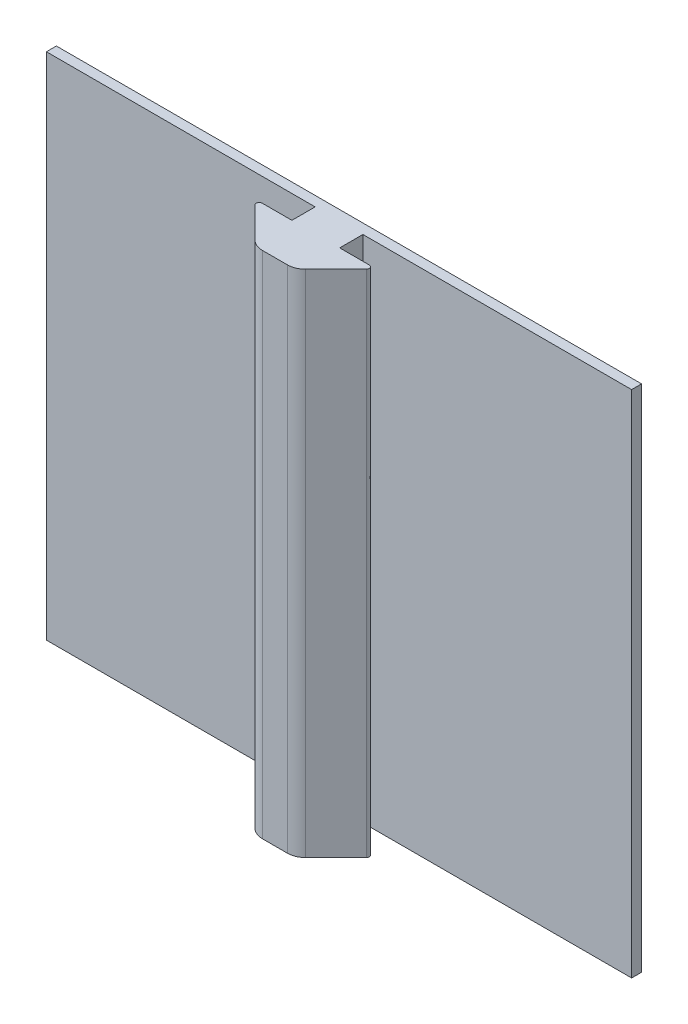
ISO-10303-21;
HEADER;
FILE_DESCRIPTION(('STEP AP214'),'2;1');
FILE_NAME('part.step','',(''),(''),'','','');
FILE_SCHEMA(('AUTOMOTIVE_DESIGN { 1 0 10303 214 1 1 1 1 }'));
ENDSEC;
DATA;
#1=APPLICATION_CONTEXT('core data for automotive mechanical design processes');
#2=APPLICATION_PROTOCOL_DEFINITION('international standard','automotive_design',2000,#1);
#3=PRODUCT_CONTEXT('',#1,'mechanical');
#4=PRODUCT('Part','Part','',(#3));
#5=PRODUCT_RELATED_PRODUCT_CATEGORY('part','',(#4));
#6=PRODUCT_DEFINITION_FORMATION('','',#4);
#7=PRODUCT_DEFINITION_CONTEXT('part definition',#1,'design');
#8=PRODUCT_DEFINITION('design','',#6,#7);
#9=PRODUCT_DEFINITION_SHAPE('','',#8);
#10=(LENGTH_UNIT() NAMED_UNIT(*) SI_UNIT(.MILLI.,.METRE.));
#11=(NAMED_UNIT(*) PLANE_ANGLE_UNIT() SI_UNIT($,.RADIAN.));
#12=(NAMED_UNIT(*) SI_UNIT($,.STERADIAN.) SOLID_ANGLE_UNIT());
#13=UNCERTAINTY_MEASURE_WITH_UNIT(LENGTH_MEASURE(1.E-05),#10,'distance_accuracy_value','');
#14=(GEOMETRIC_REPRESENTATION_CONTEXT(3) GLOBAL_UNCERTAINTY_ASSIGNED_CONTEXT((#13)) GLOBAL_UNIT_ASSIGNED_CONTEXT((#10,
#11,#12)) REPRESENTATION_CONTEXT('',''));
#15=CARTESIAN_POINT('',(0.,0.,0.));
#16=DIRECTION('',(0.,0.,1.));
#17=DIRECTION('',(1.,0.,0.));
#18=AXIS2_PLACEMENT_3D('',#15,#16,#17);
#19=CARTESIAN_POINT('',(-29.4516562602768,208.253204506271,-3.31168500692711));
#20=DIRECTION('',(0.,0.,1.));
#21=DIRECTION('',(1.,0.,0.));
#22=AXIS2_PLACEMENT_3D('',#19,#20,#21);
#23=PLANE('',#22);
#24=DIRECTION('',(1.,0.,0.));
#25=VECTOR('',#24,1.);
#26=CARTESIAN_POINT('',(-29.4516562602768,273.27720450627,-3.31168500692711));
#27=LINE('',#26,#25);
#28=CARTESIAN_POINT('',(-63.7416562602768,273.27720450627,-3.31168500692711));
#29=VERTEX_POINT('',#28);
#30=CARTESIAN_POINT('',(-29.4516562602768,273.27720450627,-3.31168500692711));
#31=VERTEX_POINT('',#30);
#32=EDGE_CURVE('E182',#29,#31,#27,.T.);
#33=ORIENTED_EDGE('',*,*,#32,.F.);
#34=DIRECTION('',(0.,1.,0.));
#35=VECTOR('',#34,1.);
#36=CARTESIAN_POINT('',(-63.7416562602768,208.253204506271,-3.31168500692711));
#37=LINE('',#36,#35);
#38=CARTESIAN_POINT('',(-63.7416562602768,208.253204506271,-3.31168500692711));
#39=VERTEX_POINT('',#38);
#40=EDGE_CURVE('E11',#39,#29,#37,.T.);
#41=ORIENTED_EDGE('',*,*,#40,.F.);
#42=DIRECTION('',(1.,0.,0.));
#43=VECTOR('',#42,1.);
#44=CARTESIAN_POINT('',(-29.4516562602768,208.253204506271,-3.31168500692711));
#45=LINE('',#44,#43);
#46=CARTESIAN_POINT('',(-29.4516562602768,208.253204506271,-3.31168500692711));
#47=VERTEX_POINT('',#46);
#48=EDGE_CURVE('E227',#39,#47,#45,.T.);
#49=ORIENTED_EDGE('',*,*,#48,.T.);
#50=DIRECTION('',(0.,1.,0.));
#51=VECTOR('',#50,1.);
#52=CARTESIAN_POINT('',(-29.4516562602768,208.253204506271,-3.31168500692711));
#53=LINE('',#52,#51);
#54=EDGE_CURVE('E117',#47,#31,#53,.T.);
#55=ORIENTED_EDGE('',*,*,#54,.T.);
#56=EDGE_LOOP('',(#33,#41,#49,#55));
#57=FACE_BOUND('',#56,.T.);
#58=ADVANCED_FACE('F37',(#57),#23,.T.);
#59=CARTESIAN_POINT('',(-63.7416562602768,208.253204506271,-3.31168500692711));
#60=DIRECTION('',(-1.,0.,0.));
#61=DIRECTION('',(0.,0.,1.));
#62=AXIS2_PLACEMENT_3D('',#59,#60,#61);
#63=PLANE('',#62);
#64=DIRECTION('',(0.,0.,1.));
#65=VECTOR('',#64,1.);
#66=CARTESIAN_POINT('',(-63.7416562602768,273.27720450627,-3.31168500692711));
#67=LINE('',#66,#65);
#68=CARTESIAN_POINT('',(-63.7416562602768,273.27720450627,-4.58168500692711));
#69=VERTEX_POINT('',#68);
#70=EDGE_CURVE('E225',#69,#29,#67,.T.);
#71=ORIENTED_EDGE('',*,*,#70,.F.);
#72=DIRECTION('',(0.,1.,0.));
#73=VECTOR('',#72,1.);
#74=CARTESIAN_POINT('',(-63.7416562602768,208.253204506271,-4.58168500692711));
#75=LINE('',#74,#73);
#76=CARTESIAN_POINT('',(-63.7416562602768,208.253204506271,-4.58168500692711));
#77=VERTEX_POINT('',#76);
#78=EDGE_CURVE('E46',#77,#69,#75,.T.);
#79=ORIENTED_EDGE('',*,*,#78,.F.);
#80=DIRECTION('',(0.,0.,1.));
#81=VECTOR('',#80,1.);
#82=CARTESIAN_POINT('',(-63.7416562602768,208.253204506271,-3.31168500692711));
#83=LINE('',#82,#81);
#84=EDGE_CURVE('E172',#77,#39,#83,.T.);
#85=ORIENTED_EDGE('',*,*,#84,.T.);
#86=ORIENTED_EDGE('',*,*,#40,.T.);
#87=EDGE_LOOP('',(#71,#79,#85,#86));
#88=FACE_BOUND('',#87,.T.);
#89=ADVANCED_FACE('F374',(#88),#63,.T.);
#90=CARTESIAN_POINT('',(-63.7416562602768,208.253204506271,-4.58168500692711));
#91=DIRECTION('',(0.,0.,-1.));
#92=DIRECTION('',(-1.,0.,0.));
#93=AXIS2_PLACEMENT_3D('',#90,#91,#92);
#94=PLANE('',#93);
#95=CARTESIAN_POINT('',(-58.424251865525,219.571645230103,-4.58168500692711));
#96=DIRECTION('',(0.,0.,-1.));
#97=DIRECTION('',(-1.,0.,0.));
#98=AXIS2_PLACEMENT_3D('',#95,#96,#97);
#99=CIRCLE('',#98,2.794);
#100=CARTESIAN_POINT('',(-61.218251865525,219.571645230103,-4.58168500692711));
#101=VERTEX_POINT('',#100);
#102=EDGE_CURVE('E488',#101,#101,#99,.T.);
#103=ORIENTED_EDGE('',*,*,#102,.F.);
#104=EDGE_LOOP('',(#103));
#105=FACE_BOUND('',#104,.T.);
#106=CARTESIAN_POINT('',(-6.35425186552498,214.491645230103,-4.58168500692711));
#107=DIRECTION('',(0.,0.,-1.));
#108=DIRECTION('',(-1.,0.,0.));
#109=AXIS2_PLACEMENT_3D('',#106,#107,#108);
#110=CIRCLE('',#109,2.794);
#111=CARTESIAN_POINT('',(-9.14825186552499,214.491645230103,-4.58168500692711));
#112=VERTEX_POINT('',#111);
#113=EDGE_CURVE('E267',#112,#112,#110,.T.);
#114=ORIENTED_EDGE('',*,*,#113,.F.);
#115=EDGE_LOOP('',(#114));
#116=FACE_BOUND('',#115,.T.);
#117=CARTESIAN_POINT('',(-58.424251865525,247.511645230103,-4.58168500692711));
#118=DIRECTION('',(0.,0.,-1.));
#119=DIRECTION('',(-1.,0.,0.));
#120=AXIS2_PLACEMENT_3D('',#117,#118,#119);
#121=CIRCLE('',#120,2.794);
#122=CARTESIAN_POINT('',(-61.218251865525,247.511645230103,-4.58168500692711));
#123=VERTEX_POINT('',#122);
#124=EDGE_CURVE('E263',#123,#123,#121,.T.);
#125=ORIENTED_EDGE('',*,*,#124,.F.);
#126=EDGE_LOOP('',(#125));
#127=FACE_BOUND('',#126,.T.);
#128=CARTESIAN_POINT('',(-7.62425186552497,262.751645230103,-4.58168500692711));
#129=DIRECTION('',(0.,0.,-1.));
#130=DIRECTION('',(-1.,0.,0.));
#131=AXIS2_PLACEMENT_3D('',#128,#129,#130);
#132=CIRCLE('',#131,2.79400000000001);
#133=CARTESIAN_POINT('',(-10.418251865525,262.751645230103,-4.58168500692711));
#134=VERTEX_POINT('',#133);
#135=EDGE_CURVE('E262',#134,#134,#132,.T.);
#136=ORIENTED_EDGE('',*,*,#135,.F.);
#137=EDGE_LOOP('',(#136));
#138=FACE_BOUND('',#137,.T.);
#139=DIRECTION('',(-1.,0.,0.));
#140=VECTOR('',#139,1.);
#141=CARTESIAN_POINT('',(-63.7416562602768,273.27720450627,-4.58168500692711));
#142=LINE('',#141,#140);
#143=CARTESIAN_POINT('',(10.9343437397232,273.27720450627,-4.58168500692711));
#144=VERTEX_POINT('',#143);
#145=EDGE_CURVE('E159',#144,#69,#142,.T.);
#146=ORIENTED_EDGE('',*,*,#145,.F.);
#147=DIRECTION('',(0.,1.,0.));
#148=VECTOR('',#147,1.);
#149=CARTESIAN_POINT('',(10.9343437397232,208.253204506271,-4.58168500692711));
#150=LINE('',#149,#148);
#151=CARTESIAN_POINT('',(10.9343437397232,208.253204506271,-4.58168500692711));
#152=VERTEX_POINT('',#151);
#153=EDGE_CURVE('E154',#152,#144,#150,.T.);
#154=ORIENTED_EDGE('',*,*,#153,.F.);
#155=DIRECTION('',(-1.,0.,0.));
#156=VECTOR('',#155,1.);
#157=CARTESIAN_POINT('',(-63.7416562602768,208.253204506271,-4.58168500692711));
#158=LINE('',#157,#156);
#159=EDGE_CURVE('E157',#152,#77,#158,.T.);
#160=ORIENTED_EDGE('',*,*,#159,.T.);
#161=ORIENTED_EDGE('',*,*,#78,.T.);
#162=EDGE_LOOP('',(#146,#154,#160,#161));
#163=FACE_BOUND('',#162,.T.);
#164=ADVANCED_FACE('F156',(#105,#116,#127,#138,#163),#94,.T.);
#165=CARTESIAN_POINT('',(10.9343437397232,208.253204506271,-4.58168500692711));
#166=DIRECTION('',(1.,0.,0.));
#167=DIRECTION('',(0.,0.,-1.));
#168=AXIS2_PLACEMENT_3D('',#165,#166,#167);
#169=PLANE('',#168);
#170=DIRECTION('',(0.,0.,-1.));
#171=VECTOR('',#170,1.);
#172=CARTESIAN_POINT('',(10.9343437397232,273.27720450627,-4.58168500692711));
#173=LINE('',#172,#171);
#174=CARTESIAN_POINT('',(10.9343437397232,273.27720450627,-3.31168500692711));
#175=VERTEX_POINT('',#174);
#176=EDGE_CURVE('E222',#175,#144,#173,.T.);
#177=ORIENTED_EDGE('',*,*,#176,.F.);
#178=DIRECTION('',(0.,1.,0.));
#179=VECTOR('',#178,1.);
#180=CARTESIAN_POINT('',(10.9343437397232,208.253204506271,-3.31168500692711));
#181=LINE('',#180,#179);
#182=CARTESIAN_POINT('',(10.9343437397232,208.253204506271,-3.31168500692711));
#183=VERTEX_POINT('',#182);
#184=EDGE_CURVE('E164',#183,#175,#181,.T.);
#185=ORIENTED_EDGE('',*,*,#184,.F.);
#186=DIRECTION('',(0.,0.,-1.));
#187=VECTOR('',#186,1.);
#188=CARTESIAN_POINT('',(10.9343437397232,208.253204506271,-4.58168500692711));
#189=LINE('',#188,#187);
#190=EDGE_CURVE('E170',#183,#152,#189,.T.);
#191=ORIENTED_EDGE('',*,*,#190,.T.);
#192=ORIENTED_EDGE('',*,*,#153,.T.);
#193=EDGE_LOOP('',(#177,#185,#191,#192));
#194=FACE_BOUND('',#193,.T.);
#195=ADVANCED_FACE('F174',(#194),#169,.T.);
#196=CARTESIAN_POINT('',(-23.3556562602768,208.253204506271,-3.31168500692711));
#197=DIRECTION('',(0.,0.,1.));
#198=DIRECTION('',(1.,0.,0.));
#199=AXIS2_PLACEMENT_3D('',#196,#197,#198);
#200=PLANE('',#199);
#201=DIRECTION('',(1.,0.,0.));
#202=VECTOR('',#201,1.);
#203=CARTESIAN_POINT('',(-23.3556562602768,273.27720450627,-3.31168500692711));
#204=LINE('',#203,#202);
#205=CARTESIAN_POINT('',(-23.3556562602768,273.27720450627,-3.31168500692711));
#206=VERTEX_POINT('',#205);
#207=EDGE_CURVE('E219',#206,#175,#204,.T.);
#208=ORIENTED_EDGE('',*,*,#207,.F.);
#209=DIRECTION('',(0.,1.,0.));
#210=VECTOR('',#209,1.);
#211=CARTESIAN_POINT('',(-23.3556562602768,208.253204506271,-3.31168500692711));
#212=LINE('',#211,#210);
#213=CARTESIAN_POINT('',(-23.3556562602768,208.253204506271,-3.31168500692711));
#214=VERTEX_POINT('',#213);
#215=EDGE_CURVE('E231',#214,#206,#212,.T.);
#216=ORIENTED_EDGE('',*,*,#215,.F.);
#217=DIRECTION('',(1.,0.,0.));
#218=VECTOR('',#217,1.);
#219=CARTESIAN_POINT('',(-23.3556562602768,208.253204506271,-3.31168500692711));
#220=LINE('',#219,#218);
#221=EDGE_CURVE('E175',#214,#183,#220,.T.);
#222=ORIENTED_EDGE('',*,*,#221,.T.);
#223=ORIENTED_EDGE('',*,*,#184,.T.);
#224=EDGE_LOOP('',(#208,#216,#222,#223));
#225=FACE_BOUND('',#224,.T.);
#226=ADVANCED_FACE('F335',(#225),#200,.T.);
#227=CARTESIAN_POINT('',(-23.3556562602768,208.253204506271,-3.13990053135263));
#228=DIRECTION('',(1.,0.,0.));
#229=DIRECTION('',(0.,0.,-1.));
#230=AXIS2_PLACEMENT_3D('',#227,#228,#229);
#231=PLANE('',#230);
#232=DIRECTION('',(0.,0.,-1.));
#233=VECTOR('',#232,1.);
#234=CARTESIAN_POINT('',(-23.3556562602768,273.27720450627,-3.13990053135263));
#235=LINE('',#234,#233);
#236=CARTESIAN_POINT('',(-23.3556562602768,273.27720450627,-0.345900531352633));
#237=VERTEX_POINT('',#236);
#238=EDGE_CURVE('E216',#237,#206,#235,.T.);
#239=ORIENTED_EDGE('',*,*,#238,.F.);
#240=DIRECTION('',(0.,1.,0.));
#241=VECTOR('',#240,1.);
#242=CARTESIAN_POINT('',(-23.3556562602768,208.253204506271,-0.345900531352633));
#243=LINE('',#242,#241);
#244=CARTESIAN_POINT('',(-23.3556562602768,208.253204506271,-0.345900531352633));
#245=VERTEX_POINT('',#244);
#246=EDGE_CURVE('E233',#245,#237,#243,.T.);
#247=ORIENTED_EDGE('',*,*,#246,.F.);
#248=DIRECTION('',(0.,0.,-1.));
#249=VECTOR('',#248,1.);
#250=CARTESIAN_POINT('',(-23.3556562602768,208.253204506271,-3.13990053135263));
#251=LINE('',#250,#249);
#252=EDGE_CURVE('E177',#245,#214,#251,.T.);
#253=ORIENTED_EDGE('',*,*,#252,.T.);
#254=ORIENTED_EDGE('',*,*,#215,.T.);
#255=EDGE_LOOP('',(#239,#247,#253,#254));
#256=FACE_BOUND('',#255,.T.);
#257=ADVANCED_FACE('F331',(#256),#231,.T.);
#258=CARTESIAN_POINT('',(-23.3556562602768,208.253204506271,-0.345900531352633));
#259=DIRECTION('',(0.,0.,-1.));
#260=DIRECTION('',(-1.,0.,0.));
#261=AXIS2_PLACEMENT_3D('',#258,#259,#260);
#262=PLANE('',#261);
#263=DIRECTION('',(-1.,0.,0.));
#264=VECTOR('',#263,1.);
#265=CARTESIAN_POINT('',(-23.3556562602768,273.27720450627,-0.345900531352633));
#266=LINE('',#265,#264);
#267=CARTESIAN_POINT('',(-19.5727330965976,273.27720450627,-0.345900531352631));
#268=VERTEX_POINT('',#267);
#269=EDGE_CURVE('E213',#268,#237,#266,.T.);
#270=ORIENTED_EDGE('',*,*,#269,.F.);
#271=DIRECTION('',(0.,1.,0.));
#272=VECTOR('',#271,1.);
#273=CARTESIAN_POINT('',(-19.5727330965976,208.253204506271,-0.345900531352631));
#274=LINE('',#273,#272);
#275=CARTESIAN_POINT('',(-19.5727330965976,208.253204506271,-0.345900531352631));
#276=VERTEX_POINT('',#275);
#277=EDGE_CURVE('E236',#276,#268,#274,.T.);
#278=ORIENTED_EDGE('',*,*,#277,.F.);
#279=DIRECTION('',(-1.,0.,0.));
#280=VECTOR('',#279,1.);
#281=CARTESIAN_POINT('',(-23.3556562602768,208.253204506271,-0.345900531352633));
#282=LINE('',#281,#280);
#283=EDGE_CURVE('E326',#276,#245,#282,.T.);
#284=ORIENTED_EDGE('',*,*,#283,.T.);
#285=ORIENTED_EDGE('',*,*,#246,.T.);
#286=EDGE_LOOP('',(#270,#278,#284,#285));
#287=FACE_BOUND('',#286,.T.);
#288=ADVANCED_FACE('F340',(#287),#262,.T.);
#289=CARTESIAN_POINT('',(-19.5727330965976,208.253204506271,0.0350994686473673));
#290=DIRECTION('',(0.,1.,0.));
#291=DIRECTION('',(0.,0.,1.));
#292=AXIS2_PLACEMENT_3D('',#289,#290,#291);
#293=CYLINDRICAL_SURFACE('',#292,0.380999999999999);
#294=CARTESIAN_POINT('',(-19.5727330965976,273.27720450627,0.0350994686473673));
#295=DIRECTION('',(0.,1.,0.));
#296=DIRECTION('',(0.,0.,1.));
#297=AXIS2_PLACEMENT_3D('',#294,#295,#296);
#298=CIRCLE('',#297,0.380999999999999);
#299=CARTESIAN_POINT('',(-19.3033254129655,273.27720450627,0.30450715227945));
#300=VERTEX_POINT('',#299);
#301=EDGE_CURVE('E210',#300,#268,#298,.T.);
#302=ORIENTED_EDGE('',*,*,#301,.F.);
#303=DIRECTION('',(0.,1.,0.));
#304=VECTOR('',#303,1.);
#305=CARTESIAN_POINT('',(-19.3033254129655,208.253204506271,0.30450715227945));
#306=LINE('',#305,#304);
#307=CARTESIAN_POINT('',(-19.3033254129655,208.253204506271,0.30450715227945));
#308=VERTEX_POINT('',#307);
#309=EDGE_CURVE('E238',#308,#300,#306,.T.);
#310=ORIENTED_EDGE('',*,*,#309,.F.);
#311=CARTESIAN_POINT('',(-19.5727330965976,208.253204506271,0.0350994686473673));
#312=DIRECTION('',(0.,1.,0.));
#313=DIRECTION('',(0.,0.,1.));
#314=AXIS2_PLACEMENT_3D('',#311,#312,#313);
#315=CIRCLE('',#314,0.380999999999999);
#316=EDGE_CURVE('E323',#308,#276,#315,.T.);
#317=ORIENTED_EDGE('',*,*,#316,.T.);
#318=ORIENTED_EDGE('',*,*,#277,.T.);
#319=EDGE_LOOP('',(#302,#310,#317,#318));
#320=FACE_BOUND('',#319,.T.);
#321=ADVANCED_FACE('F345',(#320),#293,.T.);
#322=CARTESIAN_POINT('',(-19.3033254129655,208.253204506271,0.30450715227945));
#323=DIRECTION('',(0.707106781186548,0.,0.707106781186547));
#324=DIRECTION('',(0.707106781186547,0.,-0.707106781186548));
#325=AXIS2_PLACEMENT_3D('',#322,#323,#324);
#326=PLANE('',#325);
#327=DIRECTION('',(0.707106781186547,0.,-0.707106781186548));
#328=VECTOR('',#327,1.);
#329=CARTESIAN_POINT('',(-19.3033254129655,273.27720450627,0.30450715227945));
#330=LINE('',#329,#328);
#331=CARTESIAN_POINT('',(-23.1903638311259,273.27720450627,4.19154557043982));
#332=VERTEX_POINT('',#331);
#333=EDGE_CURVE('E207',#332,#300,#330,.T.);
#334=ORIENTED_EDGE('',*,*,#333,.F.);
#335=DIRECTION('',(0.,1.,0.));
#336=VECTOR('',#335,1.);
#337=CARTESIAN_POINT('',(-23.1903638311259,208.253204506271,4.19154557043982));
#338=LINE('',#337,#336);
#339=CARTESIAN_POINT('',(-23.1903638311259,208.253204506271,4.19154557043982));
#340=VERTEX_POINT('',#339);
#341=EDGE_CURVE('E240',#340,#332,#338,.T.);
#342=ORIENTED_EDGE('',*,*,#341,.F.);
#343=DIRECTION('',(0.707106781186547,0.,-0.707106781186548));
#344=VECTOR('',#343,1.);
#345=CARTESIAN_POINT('',(-19.3033254129655,208.253204506271,0.30450715227945));
#346=LINE('',#345,#344);
#347=EDGE_CURVE('E320',#340,#308,#346,.T.);
#348=ORIENTED_EDGE('',*,*,#347,.T.);
#349=ORIENTED_EDGE('',*,*,#309,.T.);
#350=EDGE_LOOP('',(#334,#342,#348,#349));
#351=FACE_BOUND('',#350,.T.);
#352=ADVANCED_FACE('F348',(#351),#326,.T.);
#353=CARTESIAN_POINT('',(-24.8068099329183,208.253204506271,2.57509946864737));
#354=DIRECTION('',(0.,1.,0.));
#355=DIRECTION('',(0.,0.,1.));
#356=AXIS2_PLACEMENT_3D('',#353,#354,#355);
#357=CYLINDRICAL_SURFACE('',#356,2.286);
#358=CARTESIAN_POINT('',(-24.8068099329183,273.27720450627,2.57509946864737));
#359=DIRECTION('',(0.,1.,0.));
#360=DIRECTION('',(0.,0.,1.));
#361=AXIS2_PLACEMENT_3D('',#358,#359,#360);
#362=CIRCLE('',#361,2.286);
#363=CARTESIAN_POINT('',(-24.8068099329183,273.27720450627,4.86109946864737));
#364=VERTEX_POINT('',#363);
#365=EDGE_CURVE('E204',#364,#332,#362,.T.);
#366=ORIENTED_EDGE('',*,*,#365,.F.);
#367=DIRECTION('',(0.,1.,0.));
#368=VECTOR('',#367,1.);
#369=CARTESIAN_POINT('',(-24.8068099329183,208.253204506271,4.86109946864737));
#370=LINE('',#369,#368);
#371=CARTESIAN_POINT('',(-24.8068099329183,208.253204506271,4.86109946864737));
#372=VERTEX_POINT('',#371);
#373=EDGE_CURVE('E242',#372,#364,#370,.T.);
#374=ORIENTED_EDGE('',*,*,#373,.F.);
#375=CARTESIAN_POINT('',(-24.8068099329183,208.253204506271,2.57509946864737));
#376=DIRECTION('',(0.,1.,0.));
#377=DIRECTION('',(0.,0.,1.));
#378=AXIS2_PLACEMENT_3D('',#375,#376,#377);
#379=CIRCLE('',#378,2.286);
#380=EDGE_CURVE('E317',#372,#340,#379,.T.);
#381=ORIENTED_EDGE('',*,*,#380,.T.);
#382=ORIENTED_EDGE('',*,*,#341,.T.);
#383=EDGE_LOOP('',(#366,#374,#381,#382));
#384=FACE_BOUND('',#383,.T.);
#385=ADVANCED_FACE('F353',(#384),#357,.T.);
#386=CARTESIAN_POINT('',(-24.8068099329183,208.253204506271,4.86109946864737));
#387=DIRECTION('',(0.,0.,1.));
#388=DIRECTION('',(1.,0.,0.));
#389=AXIS2_PLACEMENT_3D('',#386,#387,#388);
#390=PLANE('',#389);
#391=DIRECTION('',(1.,0.,0.));
#392=VECTOR('',#391,1.);
#393=CARTESIAN_POINT('',(-24.8068099329183,273.27720450627,4.86109946864737));
#394=LINE('',#393,#392);
#395=CARTESIAN_POINT('',(-28.0005025876353,273.27720450627,4.86109946864738));
#396=VERTEX_POINT('',#395);
#397=EDGE_CURVE('E201',#396,#364,#394,.T.);
#398=ORIENTED_EDGE('',*,*,#397,.F.);
#399=DIRECTION('',(0.,1.,0.));
#400=VECTOR('',#399,1.);
#401=CARTESIAN_POINT('',(-28.0005025876353,208.253204506271,4.86109946864738));
#402=LINE('',#401,#400);
#403=CARTESIAN_POINT('',(-28.0005025876353,208.253204506271,4.86109946864738));
#404=VERTEX_POINT('',#403);
#405=EDGE_CURVE('E244',#404,#396,#402,.T.);
#406=ORIENTED_EDGE('',*,*,#405,.F.);
#407=DIRECTION('',(1.,0.,0.));
#408=VECTOR('',#407,1.);
#409=CARTESIAN_POINT('',(-24.8068099329183,208.253204506271,4.86109946864737));
#410=LINE('',#409,#408);
#411=EDGE_CURVE('E314',#404,#372,#410,.T.);
#412=ORIENTED_EDGE('',*,*,#411,.T.);
#413=ORIENTED_EDGE('',*,*,#373,.T.);
#414=EDGE_LOOP('',(#398,#406,#412,#413));
#415=FACE_BOUND('',#414,.T.);
#416=ADVANCED_FACE('F356',(#415),#390,.T.);
#417=CARTESIAN_POINT('',(-28.0005025876353,208.253204506271,2.57509946864737));
#418=DIRECTION('',(0.,1.,0.));
#419=DIRECTION('',(0.,0.,1.));
#420=AXIS2_PLACEMENT_3D('',#417,#418,#419);
#421=CYLINDRICAL_SURFACE('',#420,2.28600000000002);
#422=CARTESIAN_POINT('',(-28.0005025876353,273.27720450627,2.57509946864737));
#423=DIRECTION('',(0.,1.,0.));
#424=DIRECTION('',(0.,0.,1.));
#425=AXIS2_PLACEMENT_3D('',#422,#423,#424);
#426=CIRCLE('',#425,2.28600000000002);
#427=CARTESIAN_POINT('',(-29.6169486894278,273.27720450627,4.19154557043982));
#428=VERTEX_POINT('',#427);
#429=EDGE_CURVE('E198',#428,#396,#426,.T.);
#430=ORIENTED_EDGE('',*,*,#429,.F.);
#431=DIRECTION('',(0.,1.,0.));
#432=VECTOR('',#431,1.);
#433=CARTESIAN_POINT('',(-29.6169486894278,208.253204506271,4.19154557043982));
#434=LINE('',#433,#432);
#435=CARTESIAN_POINT('',(-29.6169486894278,208.253204506271,4.19154557043982));
#436=VERTEX_POINT('',#435);
#437=EDGE_CURVE('E246',#436,#428,#434,.T.);
#438=ORIENTED_EDGE('',*,*,#437,.F.);
#439=CARTESIAN_POINT('',(-28.0005025876353,208.253204506271,2.57509946864737));
#440=DIRECTION('',(0.,1.,0.));
#441=DIRECTION('',(0.,0.,1.));
#442=AXIS2_PLACEMENT_3D('',#439,#440,#441);
#443=CIRCLE('',#442,2.28600000000002);
#444=EDGE_CURVE('E311',#436,#404,#443,.T.);
#445=ORIENTED_EDGE('',*,*,#444,.T.);
#446=ORIENTED_EDGE('',*,*,#405,.T.);
#447=EDGE_LOOP('',(#430,#438,#445,#446));
#448=FACE_BOUND('',#447,.T.);
#449=ADVANCED_FACE('F361',(#448),#421,.T.);
#450=CARTESIAN_POINT('',(-29.6169486894278,208.253204506271,4.19154557043982));
#451=DIRECTION('',(-0.707106781186549,0.,0.707106781186546));
#452=DIRECTION('',(0.707106781186546,0.,0.707106781186549));
#453=AXIS2_PLACEMENT_3D('',#450,#451,#452);
#454=PLANE('',#453);
#455=DIRECTION('',(0.707106781186546,0.,0.707106781186549));
#456=VECTOR('',#455,1.);
#457=CARTESIAN_POINT('',(-29.6169486894278,273.27720450627,4.19154557043982));
#458=LINE('',#457,#456);
#459=CARTESIAN_POINT('',(-33.5039871075881,273.27720450627,0.304507152279445));
#460=VERTEX_POINT('',#459);
#461=EDGE_CURVE('E195',#460,#428,#458,.T.);
#462=ORIENTED_EDGE('',*,*,#461,.F.);
#463=DIRECTION('',(0.,1.,0.));
#464=VECTOR('',#463,1.);
#465=CARTESIAN_POINT('',(-33.5039871075881,208.253204506271,0.304507152279445));
#466=LINE('',#465,#464);
#467=CARTESIAN_POINT('',(-33.5039871075881,208.253204506271,0.304507152279445));
#468=VERTEX_POINT('',#467);
#469=EDGE_CURVE('E248',#468,#460,#466,.T.);
#470=ORIENTED_EDGE('',*,*,#469,.F.);
#471=DIRECTION('',(0.707106781186546,0.,0.707106781186549));
#472=VECTOR('',#471,1.);
#473=CARTESIAN_POINT('',(-29.6169486894278,208.253204506271,4.19154557043982));
#474=LINE('',#473,#472);
#475=EDGE_CURVE('E308',#468,#436,#474,.T.);
#476=ORIENTED_EDGE('',*,*,#475,.T.);
#477=ORIENTED_EDGE('',*,*,#437,.T.);
#478=EDGE_LOOP('',(#462,#470,#476,#477));
#479=FACE_BOUND('',#478,.T.);
#480=ADVANCED_FACE('F364',(#479),#454,.T.);
#481=CARTESIAN_POINT('',(-33.2345794239561,208.253204506271,0.0350994686473673));
#482=DIRECTION('',(0.,1.,0.));
#483=DIRECTION('',(0.,0.,1.));
#484=AXIS2_PLACEMENT_3D('',#481,#482,#483);
#485=CYLINDRICAL_SURFACE('',#484,0.381000000000001);
#486=CARTESIAN_POINT('',(-33.2345794239561,273.27720450627,0.0350994686473673));
#487=DIRECTION('',(0.,1.,0.));
#488=DIRECTION('',(0.,0.,1.));
#489=AXIS2_PLACEMENT_3D('',#486,#487,#488);
#490=CIRCLE('',#489,0.381000000000001);
#491=CARTESIAN_POINT('',(-33.2345794239561,273.27720450627,-0.345900531352632));
#492=VERTEX_POINT('',#491);
#493=EDGE_CURVE('E192',#492,#460,#490,.T.);
#494=ORIENTED_EDGE('',*,*,#493,.F.);
#495=DIRECTION('',(0.,1.,0.));
#496=VECTOR('',#495,1.);
#497=CARTESIAN_POINT('',(-33.2345794239561,208.253204506271,-0.345900531352632));
#498=LINE('',#497,#496);
#499=CARTESIAN_POINT('',(-33.2345794239561,208.253204506271,-0.345900531352632));
#500=VERTEX_POINT('',#499);
#501=EDGE_CURVE('E250',#500,#492,#498,.T.);
#502=ORIENTED_EDGE('',*,*,#501,.F.);
#503=CARTESIAN_POINT('',(-33.2345794239561,208.253204506271,0.0350994686473673));
#504=DIRECTION('',(0.,1.,0.));
#505=DIRECTION('',(0.,0.,1.));
#506=AXIS2_PLACEMENT_3D('',#503,#504,#505);
#507=CIRCLE('',#506,0.381000000000001);
#508=EDGE_CURVE('E305',#500,#468,#507,.T.);
#509=ORIENTED_EDGE('',*,*,#508,.T.);
#510=ORIENTED_EDGE('',*,*,#469,.T.);
#511=EDGE_LOOP('',(#494,#502,#509,#510));
#512=FACE_BOUND('',#511,.T.);
#513=ADVANCED_FACE('F369',(#512),#485,.T.);
#514=CARTESIAN_POINT('',(-33.2345794239561,208.253204506271,-0.345900531352632));
#515=DIRECTION('',(0.,0.,-1.));
#516=DIRECTION('',(-1.,0.,0.));
#517=AXIS2_PLACEMENT_3D('',#514,#515,#516);
#518=PLANE('',#517);
#519=DIRECTION('',(-1.,0.,0.));
#520=VECTOR('',#519,1.);
#521=CARTESIAN_POINT('',(-33.2345794239561,273.27720450627,-0.345900531352632));
#522=LINE('',#521,#520);
#523=CARTESIAN_POINT('',(-29.4516562602768,273.27720450627,-0.345900531352632));
#524=VERTEX_POINT('',#523);
#525=EDGE_CURVE('E189',#524,#492,#522,.T.);
#526=ORIENTED_EDGE('',*,*,#525,.F.);
#527=DIRECTION('',(0.,1.,0.));
#528=VECTOR('',#527,1.);
#529=CARTESIAN_POINT('',(-29.4516562602768,208.253204506271,-0.345900531352632));
#530=LINE('',#529,#528);
#531=CARTESIAN_POINT('',(-29.4516562602768,208.253204506271,-0.345900531352632));
#532=VERTEX_POINT('',#531);
#533=EDGE_CURVE('E252',#532,#524,#530,.T.);
#534=ORIENTED_EDGE('',*,*,#533,.F.);
#535=DIRECTION('',(-1.,0.,0.));
#536=VECTOR('',#535,1.);
#537=CARTESIAN_POINT('',(-33.2345794239561,208.253204506271,-0.345900531352632));
#538=LINE('',#537,#536);
#539=EDGE_CURVE('E302',#532,#500,#538,.T.);
#540=ORIENTED_EDGE('',*,*,#539,.T.);
#541=ORIENTED_EDGE('',*,*,#501,.T.);
#542=EDGE_LOOP('',(#526,#534,#540,#541));
#543=FACE_BOUND('',#542,.T.);
#544=ADVANCED_FACE('F372',(#543),#518,.T.);
#545=CARTESIAN_POINT('',(-29.4516562602768,208.253204506271,-0.345900531352632));
#546=DIRECTION('',(-1.,0.,0.));
#547=DIRECTION('',(0.,0.,1.));
#548=AXIS2_PLACEMENT_3D('',#545,#546,#547);
#549=PLANE('',#548);
#550=DIRECTION('',(0.,0.,1.));
#551=VECTOR('',#550,1.);
#552=CARTESIAN_POINT('',(-29.4516562602768,273.27720450627,-0.345900531352632));
#553=LINE('',#552,#551);
#554=EDGE_CURVE('E185',#31,#524,#553,.T.);
#555=ORIENTED_EDGE('',*,*,#554,.F.);
#556=ORIENTED_EDGE('',*,*,#54,.F.);
#557=DIRECTION('',(0.,0.,1.));
#558=VECTOR('',#557,1.);
#559=CARTESIAN_POINT('',(-29.4516562602768,208.253204506271,-3.13990053135263));
#560=LINE('',#559,#558);
#561=EDGE_CURVE('E300',#47,#532,#560,.T.);
#562=ORIENTED_EDGE('',*,*,#561,.T.);
#563=ORIENTED_EDGE('',*,*,#533,.T.);
#564=EDGE_LOOP('',(#555,#556,#562,#563));
#565=FACE_BOUND('',#564,.T.);
#566=ADVANCED_FACE('F410',(#565),#549,.T.);
#567=CARTESIAN_POINT('',(-19.5727330965976,208.253204506271,0.0350994686473673));
#568=DIRECTION('',(0.,1.,0.));
#569=DIRECTION('',(0.,0.,1.));
#570=AXIS2_PLACEMENT_3D('',#567,#568,#569);
#571=PLANE('',#570);
#572=ORIENTED_EDGE('',*,*,#48,.F.);
#573=ORIENTED_EDGE('',*,*,#84,.F.);
#574=ORIENTED_EDGE('',*,*,#159,.F.);
#575=ORIENTED_EDGE('',*,*,#190,.F.);
#576=ORIENTED_EDGE('',*,*,#221,.F.);
#577=ORIENTED_EDGE('',*,*,#252,.F.);
#578=ORIENTED_EDGE('',*,*,#283,.F.);
#579=ORIENTED_EDGE('',*,*,#316,.F.);
#580=ORIENTED_EDGE('',*,*,#347,.F.);
#581=ORIENTED_EDGE('',*,*,#380,.F.);
#582=ORIENTED_EDGE('',*,*,#411,.F.);
#583=ORIENTED_EDGE('',*,*,#444,.F.);
#584=ORIENTED_EDGE('',*,*,#475,.F.);
#585=ORIENTED_EDGE('',*,*,#508,.F.);
#586=ORIENTED_EDGE('',*,*,#539,.F.);
#587=ORIENTED_EDGE('',*,*,#561,.F.);
#588=EDGE_LOOP('',(#572,#573,#574,#575,#576,#577,#578,#579,#580,#581,#582,#583,#584,#585,#586,#587));
#589=FACE_BOUND('',#588,.T.);
#590=ADVANCED_FACE('F168',(#589),#571,.F.);
#591=CARTESIAN_POINT('',(-19.5727330965976,273.27720450627,0.0350994686473673));
#592=DIRECTION('',(0.,1.,0.));
#593=DIRECTION('',(0.,0.,1.));
#594=AXIS2_PLACEMENT_3D('',#591,#592,#593);
#595=PLANE('',#594);
#596=ORIENTED_EDGE('',*,*,#32,.T.);
#597=ORIENTED_EDGE('',*,*,#554,.T.);
#598=ORIENTED_EDGE('',*,*,#525,.T.);
#599=ORIENTED_EDGE('',*,*,#493,.T.);
#600=ORIENTED_EDGE('',*,*,#461,.T.);
#601=ORIENTED_EDGE('',*,*,#429,.T.);
#602=ORIENTED_EDGE('',*,*,#397,.T.);
#603=ORIENTED_EDGE('',*,*,#365,.T.);
#604=ORIENTED_EDGE('',*,*,#333,.T.);
#605=ORIENTED_EDGE('',*,*,#301,.T.);
#606=ORIENTED_EDGE('',*,*,#269,.T.);
#607=ORIENTED_EDGE('',*,*,#238,.T.);
#608=ORIENTED_EDGE('',*,*,#207,.T.);
#609=ORIENTED_EDGE('',*,*,#176,.T.);
#610=ORIENTED_EDGE('',*,*,#145,.T.);
#611=ORIENTED_EDGE('',*,*,#70,.T.);
#612=EDGE_LOOP('',(#596,#597,#598,#599,#600,#601,#602,#603,#604,#605,#606,#607,#608,#609,#610,#611));
#613=FACE_BOUND('',#612,.T.);
#614=ADVANCED_FACE('F337',(#613),#595,.T.);
#615=CARTESIAN_POINT('',(-7.62425186552497,262.751645230103,-8.39168500692711));
#616=DIRECTION('',(0.,0.,1.));
#617=DIRECTION('',(1.,0.,0.));
#618=AXIS2_PLACEMENT_3D('',#615,#616,#617);
#619=CYLINDRICAL_SURFACE('',#618,2.79400000000001);
#620=CARTESIAN_POINT('',(-7.62425186552497,262.751645230103,-8.39168500692711));
#621=DIRECTION('',(0.,0.,-1.));
#622=DIRECTION('',(-1.,0.,0.));
#623=AXIS2_PLACEMENT_3D('',#620,#621,#622);
#624=CIRCLE('',#623,2.79400000000001);
#625=CARTESIAN_POINT('',(-10.418251865525,262.751645230103,-8.39168500692711));
#626=VERTEX_POINT('',#625);
#627=EDGE_CURVE('E259',#626,#626,#624,.T.);
#628=ORIENTED_EDGE('',*,*,#627,.F.);
#629=EDGE_LOOP('',(#628));
#630=FACE_BOUND('',#629,.T.);
#631=ORIENTED_EDGE('',*,*,#135,.T.);
#632=EDGE_LOOP('',(#631));
#633=FACE_BOUND('',#632,.T.);
#634=ADVANCED_FACE('F418',(#630,#633),#619,.T.);
#635=CARTESIAN_POINT('',(-7.62425186552497,262.751645230103,-8.39168500692711));
#636=DIRECTION('',(0.,0.,-1.));
#637=DIRECTION('',(-1.,0.,0.));
#638=AXIS2_PLACEMENT_3D('',#635,#636,#637);
#639=PLANE('',#638);
#640=CARTESIAN_POINT('',(-7.62425186552497,262.751645230103,-8.39168500692711));
#641=DIRECTION('',(0.,0.,-1.));
#642=DIRECTION('',(-1.,0.,0.));
#643=AXIS2_PLACEMENT_3D('',#640,#641,#642);
#644=CIRCLE('',#643,1.52400000000001);
#645=CARTESIAN_POINT('',(-9.14825186552498,262.751645230103,-8.39168500692711));
#646=VERTEX_POINT('',#645);
#647=EDGE_CURVE('E255',#646,#646,#644,.T.);
#648=ORIENTED_EDGE('',*,*,#647,.F.);
#649=EDGE_LOOP('',(#648));
#650=FACE_BOUND('',#649,.T.);
#651=ORIENTED_EDGE('',*,*,#627,.T.);
#652=EDGE_LOOP('',(#651));
#653=FACE_BOUND('',#652,.T.);
#654=ADVANCED_FACE('F428',(#650,#653),#639,.T.);
#655=CARTESIAN_POINT('',(-7.62425186552497,262.751645230103,-12.2016850069271));
#656=DIRECTION('',(0.,0.,-1.));
#657=DIRECTION('',(-1.,0.,0.));
#658=AXIS2_PLACEMENT_3D('',#655,#656,#657);
#659=PLANE('',#658);
#660=CARTESIAN_POINT('',(-7.62425186552497,262.751645230103,-12.2016850069271));
#661=DIRECTION('',(0.,0.,-1.));
#662=DIRECTION('',(-1.,0.,0.));
#663=AXIS2_PLACEMENT_3D('',#660,#661,#662);
#664=CIRCLE('',#663,1.52400000000001);
#665=CARTESIAN_POINT('',(-9.14825186552498,262.751645230103,-12.2016850069271));
#666=VERTEX_POINT('',#665);
#667=EDGE_CURVE('E186',#666,#666,#664,.T.);
#668=ORIENTED_EDGE('',*,*,#667,.T.);
#669=EDGE_LOOP('',(#668));
#670=FACE_BOUND('',#669,.T.);
#671=ADVANCED_FACE('F424',(#670),#659,.T.);
#672=CARTESIAN_POINT('',(-7.62425186552497,262.751645230103,-12.2016850069271));
#673=DIRECTION('',(0.,0.,1.));
#674=DIRECTION('',(1.,0.,0.));
#675=AXIS2_PLACEMENT_3D('',#672,#673,#674);
#676=CYLINDRICAL_SURFACE('',#675,1.52400000000001);
#677=ORIENTED_EDGE('',*,*,#647,.T.);
#678=EDGE_LOOP('',(#677));
#679=FACE_BOUND('',#678,.T.);
#680=ORIENTED_EDGE('',*,*,#667,.F.);
#681=EDGE_LOOP('',(#680));
#682=FACE_BOUND('',#681,.T.);
#683=ADVANCED_FACE('F420',(#679,#682),#676,.T.);
#684=CARTESIAN_POINT('',(-58.424251865525,247.511645230103,-8.39168500692711));
#685=DIRECTION('',(0.,0.,1.));
#686=DIRECTION('',(1.,0.,0.));
#687=AXIS2_PLACEMENT_3D('',#684,#685,#686);
#688=CYLINDRICAL_SURFACE('',#687,2.794);
#689=CARTESIAN_POINT('',(-58.424251865525,247.511645230103,-8.39168500692711));
#690=DIRECTION('',(0.,0.,-1.));
#691=DIRECTION('',(-1.,0.,0.));
#692=AXIS2_PLACEMENT_3D('',#689,#690,#691);
#693=CIRCLE('',#692,2.794);
#694=CARTESIAN_POINT('',(-61.218251865525,247.511645230103,-8.39168500692711));
#695=VERTEX_POINT('',#694);
#696=EDGE_CURVE('E266',#695,#695,#693,.T.);
#697=ORIENTED_EDGE('',*,*,#696,.F.);
#698=EDGE_LOOP('',(#697));
#699=FACE_BOUND('',#698,.T.);
#700=ORIENTED_EDGE('',*,*,#124,.T.);
#701=EDGE_LOOP('',(#700));
#702=FACE_BOUND('',#701,.T.);
#703=ADVANCED_FACE('F423',(#699,#702),#688,.T.);
#704=CARTESIAN_POINT('',(-58.424251865525,247.511645230103,-8.39168500692711));
#705=DIRECTION('',(0.,0.,-1.));
#706=DIRECTION('',(-1.,0.,0.));
#707=AXIS2_PLACEMENT_3D('',#704,#705,#706);
#708=PLANE('',#707);
#709=CARTESIAN_POINT('',(-58.424251865525,247.511645230103,-8.39168500692711));
#710=DIRECTION('',(0.,0.,-1.));
#711=DIRECTION('',(-1.,0.,0.));
#712=AXIS2_PLACEMENT_3D('',#709,#710,#711);
#713=CIRCLE('',#712,1.524);
#714=CARTESIAN_POINT('',(-59.948251865525,247.511645230103,-8.39168500692711));
#715=VERTEX_POINT('',#714);
#716=EDGE_CURVE('E260',#715,#715,#713,.T.);
#717=ORIENTED_EDGE('',*,*,#716,.F.);
#718=EDGE_LOOP('',(#717));
#719=FACE_BOUND('',#718,.T.);
#720=ORIENTED_EDGE('',*,*,#696,.T.);
#721=EDGE_LOOP('',(#720));
#722=FACE_BOUND('',#721,.T.);
#723=ADVANCED_FACE('F434',(#719,#722),#708,.T.);
#724=CARTESIAN_POINT('',(-58.424251865525,247.511645230103,-12.2016850069271));
#725=DIRECTION('',(0.,0.,-1.));
#726=DIRECTION('',(-1.,0.,0.));
#727=AXIS2_PLACEMENT_3D('',#724,#725,#726);
#728=PLANE('',#727);
#729=CARTESIAN_POINT('',(-58.424251865525,247.511645230103,-12.2016850069271));
#730=DIRECTION('',(0.,0.,-1.));
#731=DIRECTION('',(-1.,0.,0.));
#732=AXIS2_PLACEMENT_3D('',#729,#730,#731);
#733=CIRCLE('',#732,1.524);
#734=CARTESIAN_POINT('',(-59.948251865525,247.511645230103,-12.2016850069271));
#735=VERTEX_POINT('',#734);
#736=EDGE_CURVE('E294',#735,#735,#733,.T.);
#737=ORIENTED_EDGE('',*,*,#736,.T.);
#738=EDGE_LOOP('',(#737));
#739=FACE_BOUND('',#738,.T.);
#740=ADVANCED_FACE('F430',(#739),#728,.T.);
#741=CARTESIAN_POINT('',(-58.424251865525,247.511645230103,-12.2016850069271));
#742=DIRECTION('',(0.,0.,1.));
#743=DIRECTION('',(1.,0.,0.));
#744=AXIS2_PLACEMENT_3D('',#741,#742,#743);
#745=CYLINDRICAL_SURFACE('',#744,1.524);
#746=ORIENTED_EDGE('',*,*,#716,.T.);
#747=EDGE_LOOP('',(#746));
#748=FACE_BOUND('',#747,.T.);
#749=ORIENTED_EDGE('',*,*,#736,.F.);
#750=EDGE_LOOP('',(#749));
#751=FACE_BOUND('',#750,.T.);
#752=ADVANCED_FACE('F433',(#748,#751),#745,.T.);
#753=CARTESIAN_POINT('',(-6.35425186552498,214.491645230103,-8.39168500692711));
#754=DIRECTION('',(0.,0.,1.));
#755=DIRECTION('',(1.,0.,0.));
#756=AXIS2_PLACEMENT_3D('',#753,#754,#755);
#757=CYLINDRICAL_SURFACE('',#756,2.794);
#758=CARTESIAN_POINT('',(-6.35425186552498,214.491645230103,-8.39168500692711));
#759=DIRECTION('',(0.,0.,-1.));
#760=DIRECTION('',(-1.,0.,0.));
#761=AXIS2_PLACEMENT_3D('',#758,#759,#760);
#762=CIRCLE('',#761,2.794);
#763=CARTESIAN_POINT('',(-9.14825186552499,214.491645230103,-8.39168500692711));
#764=VERTEX_POINT('',#763);
#765=EDGE_CURVE('E273',#764,#764,#762,.T.);
#766=ORIENTED_EDGE('',*,*,#765,.F.);
#767=EDGE_LOOP('',(#766));
#768=FACE_BOUND('',#767,.T.);
#769=ORIENTED_EDGE('',*,*,#113,.T.);
#770=EDGE_LOOP('',(#769));
#771=FACE_BOUND('',#770,.T.);
#772=ADVANCED_FACE('F438',(#768,#771),#757,.T.);
#773=CARTESIAN_POINT('',(-6.35425186552498,214.491645230103,-8.39168500692711));
#774=DIRECTION('',(0.,0.,-1.));
#775=DIRECTION('',(-1.,0.,0.));
#776=AXIS2_PLACEMENT_3D('',#773,#774,#775);
#777=PLANE('',#776);
#778=CARTESIAN_POINT('',(-6.35425186552498,214.491645230103,-8.39168500692711));
#779=DIRECTION('',(0.,0.,-1.));
#780=DIRECTION('',(-1.,0.,0.));
#781=AXIS2_PLACEMENT_3D('',#778,#779,#780);
#782=CIRCLE('',#781,1.524);
#783=CARTESIAN_POINT('',(-7.87825186552498,214.491645230103,-8.39168500692711));
#784=VERTEX_POINT('',#783);
#785=EDGE_CURVE('E264',#784,#784,#782,.T.);
#786=ORIENTED_EDGE('',*,*,#785,.F.);
#787=EDGE_LOOP('',(#786));
#788=FACE_BOUND('',#787,.T.);
#789=ORIENTED_EDGE('',*,*,#765,.T.);
#790=EDGE_LOOP('',(#789));
#791=FACE_BOUND('',#790,.T.);
#792=ADVANCED_FACE('F453',(#788,#791),#777,.T.);
#793=CARTESIAN_POINT('',(-6.35425186552498,214.491645230103,-12.2016850069271));
#794=DIRECTION('',(0.,0.,-1.));
#795=DIRECTION('',(-1.,0.,0.));
#796=AXIS2_PLACEMENT_3D('',#793,#794,#795);
#797=PLANE('',#796);
#798=CARTESIAN_POINT('',(-6.35425186552498,214.491645230103,-12.2016850069271));
#799=DIRECTION('',(0.,0.,-1.));
#800=DIRECTION('',(-1.,0.,0.));
#801=AXIS2_PLACEMENT_3D('',#798,#799,#800);
#802=CIRCLE('',#801,1.524);
#803=CARTESIAN_POINT('',(-7.87825186552498,214.491645230103,-12.2016850069271));
#804=VERTEX_POINT('',#803);
#805=EDGE_CURVE('E258',#804,#804,#802,.T.);
#806=ORIENTED_EDGE('',*,*,#805,.T.);
#807=EDGE_LOOP('',(#806));
#808=FACE_BOUND('',#807,.T.);
#809=ADVANCED_FACE('F449',(#808),#797,.T.);
#810=CARTESIAN_POINT('',(-6.35425186552498,214.491645230103,-12.2016850069271));
#811=DIRECTION('',(0.,0.,1.));
#812=DIRECTION('',(1.,0.,0.));
#813=AXIS2_PLACEMENT_3D('',#810,#811,#812);
#814=CYLINDRICAL_SURFACE('',#813,1.524);
#815=ORIENTED_EDGE('',*,*,#785,.T.);
#816=EDGE_LOOP('',(#815));
#817=FACE_BOUND('',#816,.T.);
#818=ORIENTED_EDGE('',*,*,#805,.F.);
#819=EDGE_LOOP('',(#818));
#820=FACE_BOUND('',#819,.T.);
#821=ADVANCED_FACE('F452',(#817,#820),#814,.T.);
#822=CARTESIAN_POINT('',(-58.424251865525,219.571645230103,-8.39168500692711));
#823=DIRECTION('',(0.,0.,1.));
#824=DIRECTION('',(1.,0.,0.));
#825=AXIS2_PLACEMENT_3D('',#822,#823,#824);
#826=CYLINDRICAL_SURFACE('',#825,2.794);
#827=CARTESIAN_POINT('',(-58.424251865525,219.571645230103,-8.39168500692711));
#828=DIRECTION('',(0.,0.,-1.));
#829=DIRECTION('',(-1.,0.,0.));
#830=AXIS2_PLACEMENT_3D('',#827,#828,#829);
#831=CIRCLE('',#830,2.794);
#832=CARTESIAN_POINT('',(-61.218251865525,219.571645230103,-8.39168500692711));
#833=VERTEX_POINT('',#832);
#834=EDGE_CURVE('E280',#833,#833,#831,.T.);
#835=ORIENTED_EDGE('',*,*,#834,.F.);
#836=EDGE_LOOP('',(#835));
#837=FACE_BOUND('',#836,.T.);
#838=ORIENTED_EDGE('',*,*,#102,.T.);
#839=EDGE_LOOP('',(#838));
#840=FACE_BOUND('',#839,.T.);
#841=ADVANCED_FACE('F457',(#837,#840),#826,.T.);
#842=CARTESIAN_POINT('',(-58.424251865525,219.571645230103,-8.39168500692711));
#843=DIRECTION('',(0.,0.,-1.));
#844=DIRECTION('',(-1.,0.,0.));
#845=AXIS2_PLACEMENT_3D('',#842,#843,#844);
#846=PLANE('',#845);
#847=CARTESIAN_POINT('',(-58.424251865525,219.571645230103,-8.39168500692711));
#848=DIRECTION('',(0.,0.,-1.));
#849=DIRECTION('',(-1.,0.,0.));
#850=AXIS2_PLACEMENT_3D('',#847,#848,#849);
#851=CIRCLE('',#850,1.524);
#852=CARTESIAN_POINT('',(-59.948251865525,219.571645230103,-8.39168500692711));
#853=VERTEX_POINT('',#852);
#854=EDGE_CURVE('E40',#853,#853,#851,.T.);
#855=ORIENTED_EDGE('',*,*,#854,.F.);
#856=EDGE_LOOP('',(#855));
#857=FACE_BOUND('',#856,.T.);
#858=ORIENTED_EDGE('',*,*,#834,.T.);
#859=EDGE_LOOP('',(#858));
#860=FACE_BOUND('',#859,.T.);
#861=ADVANCED_FACE('F444',(#857,#860),#846,.T.);
#862=CARTESIAN_POINT('',(-58.424251865525,219.571645230103,-12.2016850069271));
#863=DIRECTION('',(0.,0.,-1.));
#864=DIRECTION('',(-1.,0.,0.));
#865=AXIS2_PLACEMENT_3D('',#862,#863,#864);
#866=PLANE('',#865);
#867=CARTESIAN_POINT('',(-58.424251865525,219.571645230103,-12.2016850069271));
#868=DIRECTION('',(0.,0.,-1.));
#869=DIRECTION('',(-1.,0.,0.));
#870=AXIS2_PLACEMENT_3D('',#867,#868,#869);
#871=CIRCLE('',#870,1.524);
#872=CARTESIAN_POINT('',(-59.948251865525,219.571645230103,-12.2016850069271));
#873=VERTEX_POINT('',#872);
#874=EDGE_CURVE('E291',#873,#873,#871,.T.);
#875=ORIENTED_EDGE('',*,*,#874,.T.);
#876=EDGE_LOOP('',(#875));
#877=FACE_BOUND('',#876,.T.);
#878=ADVANCED_FACE('F440',(#877),#866,.T.);
#879=CARTESIAN_POINT('',(-58.424251865525,219.571645230103,-12.2016850069271));
#880=DIRECTION('',(0.,0.,1.));
#881=DIRECTION('',(1.,0.,0.));
#882=AXIS2_PLACEMENT_3D('',#879,#880,#881);
#883=CYLINDRICAL_SURFACE('',#882,1.524);
#884=ORIENTED_EDGE('',*,*,#854,.T.);
#885=EDGE_LOOP('',(#884));
#886=FACE_BOUND('',#885,.T.);
#887=ORIENTED_EDGE('',*,*,#874,.F.);
#888=EDGE_LOOP('',(#887));
#889=FACE_BOUND('',#888,.T.);
#890=ADVANCED_FACE('F443',(#886,#889),#883,.T.);
#891=CLOSED_SHELL('',(#58,#89,#164,#195,#226,#257,#288,#321,#352,#385,#416,#449,#480,#513,#544,
#566,#590,#614,#634,#654,#671,#683,#703,#723,#740,#752,#772,#792,#809,#821,#841,#861,#878,#890));
#892=MANIFOLD_SOLID_BREP('B2',#891);
#893=ADVANCED_BREP_SHAPE_REPRESENTATION('',(#18,#892),#14);
#894=SHAPE_DEFINITION_REPRESENTATION(#9,#893);
ENDSEC;
END-ISO-10303-21;
